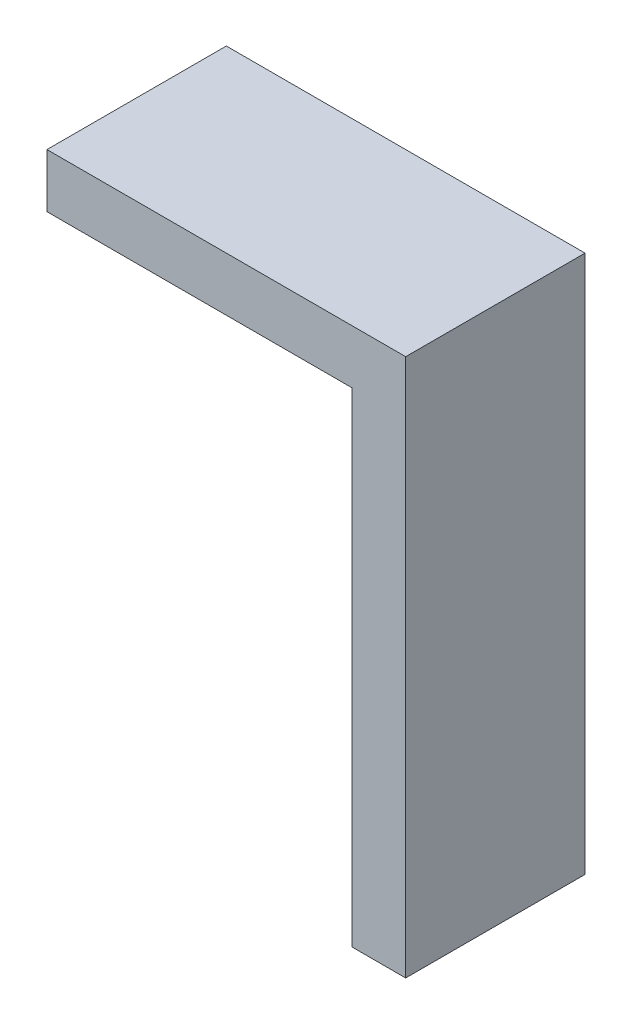
ISO-10303-21;
HEADER;
FILE_DESCRIPTION(('STEP AP214'),'2;1');
FILE_NAME('part.step','',(''),(''),'','','');
FILE_SCHEMA(('AUTOMOTIVE_DESIGN { 1 0 10303 214 1 1 1 1 }'));
ENDSEC;
DATA;
#1=APPLICATION_CONTEXT('core data for automotive mechanical design processes');
#2=APPLICATION_PROTOCOL_DEFINITION('international standard','automotive_design',2000,#1);
#3=PRODUCT_CONTEXT('',#1,'mechanical');
#4=PRODUCT('Part','Part','',(#3));
#5=PRODUCT_RELATED_PRODUCT_CATEGORY('part','',(#4));
#6=PRODUCT_DEFINITION_FORMATION('','',#4);
#7=PRODUCT_DEFINITION_CONTEXT('part definition',#1,'design');
#8=PRODUCT_DEFINITION('design','',#6,#7);
#9=PRODUCT_DEFINITION_SHAPE('','',#8);
#10=(LENGTH_UNIT() NAMED_UNIT(*) SI_UNIT(.MILLI.,.METRE.));
#11=(NAMED_UNIT(*) PLANE_ANGLE_UNIT() SI_UNIT($,.RADIAN.));
#12=(NAMED_UNIT(*) SI_UNIT($,.STERADIAN.) SOLID_ANGLE_UNIT());
#13=UNCERTAINTY_MEASURE_WITH_UNIT(LENGTH_MEASURE(1.E-05),#10,'distance_accuracy_value','');
#14=(GEOMETRIC_REPRESENTATION_CONTEXT(3) GLOBAL_UNCERTAINTY_ASSIGNED_CONTEXT((#13)) GLOBAL_UNIT_ASSIGNED_CONTEXT((#10,
#11,#12)) REPRESENTATION_CONTEXT('',''));
#15=CARTESIAN_POINT('',(0.,0.,0.));
#16=DIRECTION('',(0.,0.,1.));
#17=DIRECTION('',(1.,0.,0.));
#18=AXIS2_PLACEMENT_3D('',#15,#16,#17);
#19=CARTESIAN_POINT('',(-47.8279594673418,17.5290280624711,10.));
#20=DIRECTION('',(1.,0.,0.));
#21=DIRECTION('',(0.,0.,-1.));
#22=AXIS2_PLACEMENT_3D('',#19,#20,#21);
#23=PLANE('',#22);
#24=DIRECTION('',(0.,-1.,0.));
#25=VECTOR('',#24,1.);
#26=CARTESIAN_POINT('',(-47.8279594673418,17.5290280624711,0.));
#27=LINE('',#26,#25);
#28=CARTESIAN_POINT('',(-47.8279594673418,20.529028062471,0.));
#29=VERTEX_POINT('',#28);
#30=CARTESIAN_POINT('',(-47.8279594673418,17.5290280624711,0.));
#31=VERTEX_POINT('',#30);
#32=EDGE_CURVE('E119',#29,#31,#27,.T.);
#33=ORIENTED_EDGE('',*,*,#32,.T.);
#34=DIRECTION('',(0.,0.,-1.));
#35=VECTOR('',#34,1.);
#36=CARTESIAN_POINT('',(-47.8279594673418,17.5290280624711,10.));
#37=LINE('',#36,#35);
#38=CARTESIAN_POINT('',(-47.8279594673418,17.5290280624711,10.));
#39=VERTEX_POINT('',#38);
#40=EDGE_CURVE('E11',#39,#31,#37,.T.);
#41=ORIENTED_EDGE('',*,*,#40,.F.);
#42=DIRECTION('',(0.,-1.,0.));
#43=VECTOR('',#42,1.);
#44=CARTESIAN_POINT('',(-47.8279594673418,17.5290280624711,10.));
#45=LINE('',#44,#43);
#46=CARTESIAN_POINT('',(-47.8279594673418,20.529028062471,10.));
#47=VERTEX_POINT('',#46);
#48=EDGE_CURVE('E129',#47,#39,#45,.T.);
#49=ORIENTED_EDGE('',*,*,#48,.F.);
#50=DIRECTION('',(0.,0.,-1.));
#51=VECTOR('',#50,1.);
#52=CARTESIAN_POINT('',(-47.8279594673418,20.529028062471,10.));
#53=LINE('',#52,#51);
#54=EDGE_CURVE('E115',#47,#29,#53,.T.);
#55=ORIENTED_EDGE('',*,*,#54,.T.);
#56=EDGE_LOOP('',(#33,#41,#49,#55));
#57=FACE_BOUND('',#56,.T.);
#58=ADVANCED_FACE('F35',(#57),#23,.F.);
#59=CARTESIAN_POINT('',(-30.8279594673418,17.5290280624711,10.));
#60=DIRECTION('',(0.,1.,0.));
#61=DIRECTION('',(0.,0.,1.));
#62=AXIS2_PLACEMENT_3D('',#59,#60,#61);
#63=PLANE('',#62);
#64=DIRECTION('',(1.,0.,0.));
#65=VECTOR('',#64,1.);
#66=CARTESIAN_POINT('',(-30.8279594673418,17.5290280624711,0.));
#67=LINE('',#66,#65);
#68=CARTESIAN_POINT('',(-30.8279594673418,17.5290280624711,0.));
#69=VERTEX_POINT('',#68);
#70=EDGE_CURVE('E122',#31,#69,#67,.T.);
#71=ORIENTED_EDGE('',*,*,#70,.T.);
#72=DIRECTION('',(0.,0.,-1.));
#73=VECTOR('',#72,1.);
#74=CARTESIAN_POINT('',(-30.8279594673418,17.5290280624711,10.));
#75=LINE('',#74,#73);
#76=CARTESIAN_POINT('',(-30.8279594673418,17.5290280624711,10.));
#77=VERTEX_POINT('',#76);
#78=EDGE_CURVE('E43',#77,#69,#75,.T.);
#79=ORIENTED_EDGE('',*,*,#78,.F.);
#80=DIRECTION('',(1.,0.,0.));
#81=VECTOR('',#80,1.);
#82=CARTESIAN_POINT('',(-30.8279594673418,17.5290280624711,10.));
#83=LINE('',#82,#81);
#84=EDGE_CURVE('E88',#39,#77,#83,.T.);
#85=ORIENTED_EDGE('',*,*,#84,.F.);
#86=ORIENTED_EDGE('',*,*,#40,.T.);
#87=EDGE_LOOP('',(#71,#79,#85,#86));
#88=FACE_BOUND('',#87,.T.);
#89=ADVANCED_FACE('F153',(#88),#63,.F.);
#90=CARTESIAN_POINT('',(-30.8279594673418,-9.47097193752895,10.));
#91=DIRECTION('',(1.,0.,0.));
#92=DIRECTION('',(0.,1.,0.));
#93=AXIS2_PLACEMENT_3D('',#90,#91,#92);
#94=PLANE('',#93);
#95=DIRECTION('',(0.,-1.,0.));
#96=VECTOR('',#95,1.);
#97=CARTESIAN_POINT('',(-30.8279594673418,-9.47097193752895,0.));
#98=LINE('',#97,#96);
#99=CARTESIAN_POINT('',(-30.8279594673418,-9.47097193752895,0.));
#100=VERTEX_POINT('',#99);
#101=EDGE_CURVE('E124',#69,#100,#98,.T.);
#102=ORIENTED_EDGE('',*,*,#101,.T.);
#103=DIRECTION('',(0.,0.,-1.));
#104=VECTOR('',#103,1.);
#105=CARTESIAN_POINT('',(-30.8279594673418,-9.47097193752895,10.));
#106=LINE('',#105,#104);
#107=CARTESIAN_POINT('',(-30.8279594673418,-9.47097193752895,10.));
#108=VERTEX_POINT('',#107);
#109=EDGE_CURVE('E110',#108,#100,#106,.T.);
#110=ORIENTED_EDGE('',*,*,#109,.F.);
#111=DIRECTION('',(0.,-1.,0.));
#112=VECTOR('',#111,1.);
#113=CARTESIAN_POINT('',(-30.8279594673418,-9.47097193752895,10.));
#114=LINE('',#113,#112);
#115=EDGE_CURVE('E101',#77,#108,#114,.T.);
#116=ORIENTED_EDGE('',*,*,#115,.F.);
#117=ORIENTED_EDGE('',*,*,#78,.T.);
#118=EDGE_LOOP('',(#102,#110,#116,#117));
#119=FACE_BOUND('',#118,.T.);
#120=ADVANCED_FACE('F135',(#119),#94,.F.);
#121=CARTESIAN_POINT('',(-27.8279594673418,-9.47097193752895,10.));
#122=DIRECTION('',(0.,1.,0.));
#123=DIRECTION('',(0.,0.,1.));
#124=AXIS2_PLACEMENT_3D('',#121,#122,#123);
#125=PLANE('',#124);
#126=DIRECTION('',(1.,0.,0.));
#127=VECTOR('',#126,1.);
#128=CARTESIAN_POINT('',(-27.8279594673418,-9.47097193752895,0.));
#129=LINE('',#128,#127);
#130=CARTESIAN_POINT('',(-27.8279594673418,-9.47097193752895,0.));
#131=VERTEX_POINT('',#130);
#132=EDGE_CURVE('E109',#100,#131,#129,.T.);
#133=ORIENTED_EDGE('',*,*,#132,.T.);
#134=DIRECTION('',(0.,0.,-1.));
#135=VECTOR('',#134,1.);
#136=CARTESIAN_POINT('',(-27.8279594673418,-9.47097193752895,10.));
#137=LINE('',#136,#135);
#138=CARTESIAN_POINT('',(-27.8279594673418,-9.47097193752895,10.));
#139=VERTEX_POINT('',#138);
#140=EDGE_CURVE('E106',#139,#131,#137,.T.);
#141=ORIENTED_EDGE('',*,*,#140,.F.);
#142=DIRECTION('',(1.,0.,0.));
#143=VECTOR('',#142,1.);
#144=CARTESIAN_POINT('',(-27.8279594673418,-9.47097193752895,10.));
#145=LINE('',#144,#143);
#146=EDGE_CURVE('E95',#108,#139,#145,.T.);
#147=ORIENTED_EDGE('',*,*,#146,.F.);
#148=ORIENTED_EDGE('',*,*,#109,.T.);
#149=EDGE_LOOP('',(#133,#141,#147,#148));
#150=FACE_BOUND('',#149,.T.);
#151=ADVANCED_FACE('F107',(#150),#125,.F.);
#152=CARTESIAN_POINT('',(-27.8279594673418,20.529028062471,10.));
#153=DIRECTION('',(-1.,0.,0.));
#154=DIRECTION('',(0.,-1.,0.));
#155=AXIS2_PLACEMENT_3D('',#152,#153,#154);
#156=PLANE('',#155);
#157=DIRECTION('',(0.,1.,0.));
#158=VECTOR('',#157,1.);
#159=CARTESIAN_POINT('',(-27.8279594673418,20.529028062471,0.));
#160=LINE('',#159,#158);
#161=CARTESIAN_POINT('',(-27.8279594673418,20.529028062471,0.));
#162=VERTEX_POINT('',#161);
#163=EDGE_CURVE('E74',#131,#162,#160,.T.);
#164=ORIENTED_EDGE('',*,*,#163,.T.);
#165=DIRECTION('',(0.,0.,-1.));
#166=VECTOR('',#165,1.);
#167=CARTESIAN_POINT('',(-27.8279594673418,20.529028062471,10.));
#168=LINE('',#167,#166);
#169=CARTESIAN_POINT('',(-27.8279594673418,20.529028062471,10.));
#170=VERTEX_POINT('',#169);
#171=EDGE_CURVE('E111',#170,#162,#168,.T.);
#172=ORIENTED_EDGE('',*,*,#171,.F.);
#173=DIRECTION('',(0.,1.,0.));
#174=VECTOR('',#173,1.);
#175=CARTESIAN_POINT('',(-27.8279594673418,20.529028062471,10.));
#176=LINE('',#175,#174);
#177=EDGE_CURVE('E99',#139,#170,#176,.T.);
#178=ORIENTED_EDGE('',*,*,#177,.F.);
#179=ORIENTED_EDGE('',*,*,#140,.T.);
#180=EDGE_LOOP('',(#164,#172,#178,#179));
#181=FACE_BOUND('',#180,.T.);
#182=ADVANCED_FACE('F113',(#181),#156,.F.);
#183=CARTESIAN_POINT('',(-47.8279594673418,20.529028062471,10.));
#184=DIRECTION('',(0.,-1.,0.));
#185=DIRECTION('',(0.,0.,-1.));
#186=AXIS2_PLACEMENT_3D('',#183,#184,#185);
#187=PLANE('',#186);
#188=DIRECTION('',(-1.,0.,0.));
#189=VECTOR('',#188,1.);
#190=CARTESIAN_POINT('',(-47.8279594673418,20.529028062471,0.));
#191=LINE('',#190,#189);
#192=EDGE_CURVE('E80',#162,#29,#191,.T.);
#193=ORIENTED_EDGE('',*,*,#192,.T.);
#194=ORIENTED_EDGE('',*,*,#54,.F.);
#195=DIRECTION('',(-1.,0.,0.));
#196=VECTOR('',#195,1.);
#197=CARTESIAN_POINT('',(-47.8279594673418,20.529028062471,10.));
#198=LINE('',#197,#196);
#199=EDGE_CURVE('E51',#170,#47,#198,.T.);
#200=ORIENTED_EDGE('',*,*,#199,.F.);
#201=ORIENTED_EDGE('',*,*,#171,.T.);
#202=EDGE_LOOP('',(#193,#194,#200,#201));
#203=FACE_BOUND('',#202,.T.);
#204=ADVANCED_FACE('F142',(#203),#187,.F.);
#205=CARTESIAN_POINT('',(0.,0.,10.));
#206=DIRECTION('',(0.,0.,-1.));
#207=DIRECTION('',(-1.,0.,0.));
#208=AXIS2_PLACEMENT_3D('',#205,#206,#207);
#209=PLANE('',#208);
#210=ORIENTED_EDGE('',*,*,#48,.T.);
#211=ORIENTED_EDGE('',*,*,#84,.T.);
#212=ORIENTED_EDGE('',*,*,#115,.T.);
#213=ORIENTED_EDGE('',*,*,#146,.T.);
#214=ORIENTED_EDGE('',*,*,#177,.T.);
#215=ORIENTED_EDGE('',*,*,#199,.T.);
#216=EDGE_LOOP('',(#210,#211,#212,#213,#214,#215));
#217=FACE_BOUND('',#216,.T.);
#218=ADVANCED_FACE('F97',(#217),#209,.F.);
#219=CARTESIAN_POINT('',(0.,0.,0.));
#220=DIRECTION('',(0.,0.,-1.));
#221=DIRECTION('',(-1.,0.,0.));
#222=AXIS2_PLACEMENT_3D('',#219,#220,#221);
#223=PLANE('',#222);
#224=ORIENTED_EDGE('',*,*,#32,.F.);
#225=ORIENTED_EDGE('',*,*,#192,.F.);
#226=ORIENTED_EDGE('',*,*,#163,.F.);
#227=ORIENTED_EDGE('',*,*,#132,.F.);
#228=ORIENTED_EDGE('',*,*,#101,.F.);
#229=ORIENTED_EDGE('',*,*,#70,.F.);
#230=EDGE_LOOP('',(#224,#225,#226,#227,#228,#229));
#231=FACE_BOUND('',#230,.T.);
#232=ADVANCED_FACE('F138',(#231),#223,.T.);
#233=CLOSED_SHELL('',(#58,#89,#120,#151,#182,#204,#218,#232));
#234=MANIFOLD_SOLID_BREP('B2',#233);
#235=ADVANCED_BREP_SHAPE_REPRESENTATION('',(#18,#234),#14);
#236=SHAPE_DEFINITION_REPRESENTATION(#9,#235);
ENDSEC;
END-ISO-10303-21;
